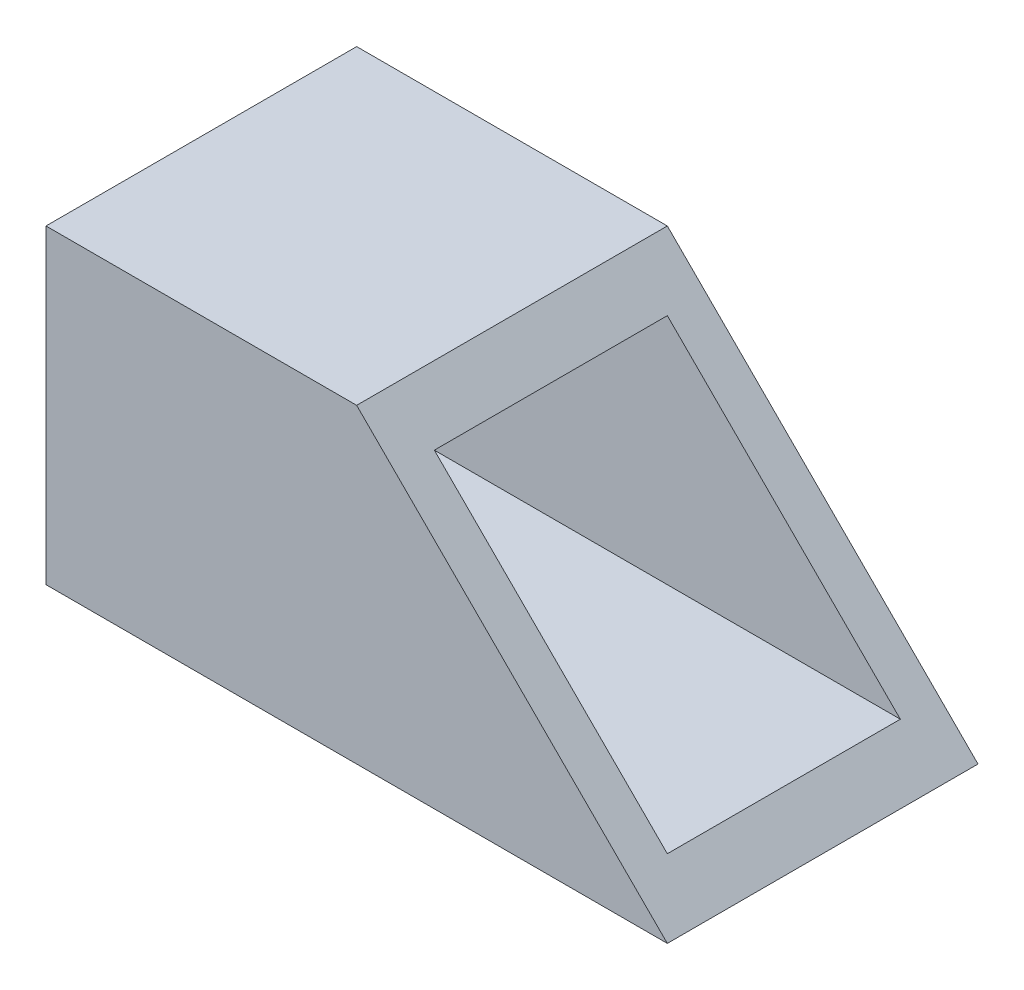
ISO-10303-21;
HEADER;
FILE_DESCRIPTION(('STEP AP214'),'2;1');
FILE_NAME('part.step','',(''),(''),'','','');
FILE_SCHEMA(('AUTOMOTIVE_DESIGN { 1 0 10303 214 1 1 1 1 }'));
ENDSEC;
DATA;
#1=APPLICATION_CONTEXT('core data for automotive mechanical design processes');
#2=APPLICATION_PROTOCOL_DEFINITION('international standard','automotive_design',2000,#1);
#3=PRODUCT_CONTEXT('',#1,'mechanical');
#4=PRODUCT('Part','Part','',(#3));
#5=PRODUCT_RELATED_PRODUCT_CATEGORY('part','',(#4));
#6=PRODUCT_DEFINITION_FORMATION('','',#4);
#7=PRODUCT_DEFINITION_CONTEXT('part definition',#1,'design');
#8=PRODUCT_DEFINITION('design','',#6,#7);
#9=PRODUCT_DEFINITION_SHAPE('','',#8);
#10=(LENGTH_UNIT() NAMED_UNIT(*) SI_UNIT(.MILLI.,.METRE.));
#11=(NAMED_UNIT(*) PLANE_ANGLE_UNIT() SI_UNIT($,.RADIAN.));
#12=(NAMED_UNIT(*) SI_UNIT($,.STERADIAN.) SOLID_ANGLE_UNIT());
#13=UNCERTAINTY_MEASURE_WITH_UNIT(LENGTH_MEASURE(1.E-05),#10,'distance_accuracy_value','');
#14=(GEOMETRIC_REPRESENTATION_CONTEXT(3) GLOBAL_UNCERTAINTY_ASSIGNED_CONTEXT((#13)) GLOBAL_UNIT_ASSIGNED_CONTEXT((#10,
#11,#12)) REPRESENTATION_CONTEXT('',''));
#15=CARTESIAN_POINT('',(0.,0.,0.));
#16=DIRECTION('',(0.,0.,1.));
#17=DIRECTION('',(1.,0.,0.));
#18=AXIS2_PLACEMENT_3D('',#15,#16,#17);
#19=CARTESIAN_POINT('',(0.,0.,0.));
#20=DIRECTION('',(1.,0.,0.));
#21=DIRECTION('',(0.,0.,-1.));
#22=AXIS2_PLACEMENT_3D('',#19,#20,#21);
#23=PLANE('',#22);
#24=DIRECTION('',(0.,-1.,0.));
#25=VECTOR('',#24,1.);
#26=CARTESIAN_POINT('',(0.,-12.7,12.7));
#27=LINE('',#26,#25);
#28=CARTESIAN_POINT('',(0.,12.7,12.7));
#29=VERTEX_POINT('',#28);
#30=CARTESIAN_POINT('',(0.,-12.7,12.7));
#31=VERTEX_POINT('',#30);
#32=EDGE_CURVE('E130',#29,#31,#27,.T.);
#33=ORIENTED_EDGE('',*,*,#32,.F.);
#34=DIRECTION('',(0.,0.,1.));
#35=VECTOR('',#34,1.);
#36=CARTESIAN_POINT('',(0.,12.7,-12.7));
#37=LINE('',#36,#35);
#38=CARTESIAN_POINT('',(0.,12.7,-12.7));
#39=VERTEX_POINT('',#38);
#40=EDGE_CURVE('E127',#39,#29,#37,.T.);
#41=ORIENTED_EDGE('',*,*,#40,.F.);
#42=DIRECTION('',(0.,1.,0.));
#43=VECTOR('',#42,1.);
#44=CARTESIAN_POINT('',(0.,-12.7,-12.7));
#45=LINE('',#44,#43);
#46=CARTESIAN_POINT('',(0.,-12.7,-12.7));
#47=VERTEX_POINT('',#46);
#48=EDGE_CURVE('E143',#47,#39,#45,.T.);
#49=ORIENTED_EDGE('',*,*,#48,.F.);
#50=DIRECTION('',(0.,0.,-1.));
#51=VECTOR('',#50,1.);
#52=CARTESIAN_POINT('',(0.,-12.7,-12.7));
#53=LINE('',#52,#51);
#54=EDGE_CURVE('E147',#31,#47,#53,.T.);
#55=ORIENTED_EDGE('',*,*,#54,.F.);
#56=EDGE_LOOP('',(#33,#41,#49,#55));
#57=FACE_BOUND('',#56,.T.);
#58=DIRECTION('',(0.,-1.,0.));
#59=VECTOR('',#58,1.);
#60=CARTESIAN_POINT('',(0.,-9.525,9.525));
#61=LINE('',#60,#59);
#62=CARTESIAN_POINT('',(0.,9.525,9.525));
#63=VERTEX_POINT('',#62);
#64=CARTESIAN_POINT('',(0.,-9.525,9.525));
#65=VERTEX_POINT('',#64);
#66=EDGE_CURVE('E176',#63,#65,#61,.T.);
#67=ORIENTED_EDGE('',*,*,#66,.T.);
#68=DIRECTION('',(0.,0.,-1.));
#69=VECTOR('',#68,1.);
#70=CARTESIAN_POINT('',(0.,-9.525,-9.525));
#71=LINE('',#70,#69);
#72=CARTESIAN_POINT('',(0.,-9.525,-9.525));
#73=VERTEX_POINT('',#72);
#74=EDGE_CURVE('E172',#65,#73,#71,.T.);
#75=ORIENTED_EDGE('',*,*,#74,.T.);
#76=DIRECTION('',(0.,1.,0.));
#77=VECTOR('',#76,1.);
#78=CARTESIAN_POINT('',(0.,-9.525,-9.525));
#79=LINE('',#78,#77);
#80=CARTESIAN_POINT('',(0.,9.525,-9.525));
#81=VERTEX_POINT('',#80);
#82=EDGE_CURVE('E168',#73,#81,#79,.T.);
#83=ORIENTED_EDGE('',*,*,#82,.T.);
#84=DIRECTION('',(0.,0.,1.));
#85=VECTOR('',#84,1.);
#86=CARTESIAN_POINT('',(0.,9.525,-9.525));
#87=LINE('',#86,#85);
#88=EDGE_CURVE('E164',#81,#63,#87,.T.);
#89=ORIENTED_EDGE('',*,*,#88,.T.);
#90=EDGE_LOOP('',(#67,#75,#83,#89));
#91=FACE_BOUND('',#90,.T.);
#92=ADVANCED_FACE('F45',(#57,#91),#23,.F.);
#93=CARTESIAN_POINT('',(50.8,-12.7,12.7));
#94=DIRECTION('',(0.,0.,-1.));
#95=DIRECTION('',(-1.,0.,0.));
#96=AXIS2_PLACEMENT_3D('',#93,#94,#95);
#97=PLANE('',#96);
#98=DIRECTION('',(-1.,0.,0.));
#99=VECTOR('',#98,1.);
#100=CARTESIAN_POINT('',(50.8,-12.7,12.7));
#101=LINE('',#100,#99);
#102=CARTESIAN_POINT('',(50.8,-12.7,12.7));
#103=VERTEX_POINT('',#102);
#104=EDGE_CURVE('E54',#103,#31,#101,.T.);
#105=ORIENTED_EDGE('',*,*,#104,.F.);
#106=DIRECTION('',(-0.707106781186546,0.707106781186549,0.));
#107=VECTOR('',#106,1.);
#108=CARTESIAN_POINT('',(50.8,-12.7,12.7));
#109=LINE('',#108,#107);
#110=CARTESIAN_POINT('',(25.4000000000001,12.7,12.7));
#111=VERTEX_POINT('',#110);
#112=EDGE_CURVE('E108',#103,#111,#109,.T.);
#113=ORIENTED_EDGE('',*,*,#112,.T.);
#114=DIRECTION('',(-1.,0.,0.));
#115=VECTOR('',#114,1.);
#116=CARTESIAN_POINT('',(50.8,12.7,12.7));
#117=LINE('',#116,#115);
#118=EDGE_CURVE('E126',#111,#29,#117,.T.);
#119=ORIENTED_EDGE('',*,*,#118,.T.);
#120=ORIENTED_EDGE('',*,*,#32,.T.);
#121=EDGE_LOOP('',(#105,#113,#119,#120));
#122=FACE_BOUND('',#121,.T.);
#123=ADVANCED_FACE('F47',(#122),#97,.F.);
#124=CARTESIAN_POINT('',(50.8,-12.7,-12.7));
#125=DIRECTION('',(0.,1.,0.));
#126=DIRECTION('',(0.,0.,1.));
#127=AXIS2_PLACEMENT_3D('',#124,#125,#126);
#128=PLANE('',#127);
#129=ORIENTED_EDGE('',*,*,#54,.T.);
#130=DIRECTION('',(-1.,0.,0.));
#131=VECTOR('',#130,1.);
#132=CARTESIAN_POINT('',(50.8,-12.7,-12.7));
#133=LINE('',#132,#131);
#134=CARTESIAN_POINT('',(50.8,-12.7,-12.7));
#135=VERTEX_POINT('',#134);
#136=EDGE_CURVE('E124',#135,#47,#133,.T.);
#137=ORIENTED_EDGE('',*,*,#136,.F.);
#138=DIRECTION('',(0.,0.,-1.));
#139=VECTOR('',#138,1.);
#140=CARTESIAN_POINT('',(50.8,-12.7,-12.7));
#141=LINE('',#140,#139);
#142=EDGE_CURVE('E111',#103,#135,#141,.T.);
#143=ORIENTED_EDGE('',*,*,#142,.F.);
#144=ORIENTED_EDGE('',*,*,#104,.T.);
#145=EDGE_LOOP('',(#129,#137,#143,#144));
#146=FACE_BOUND('',#145,.T.);
#147=ADVANCED_FACE('F121',(#146),#128,.F.);
#148=CARTESIAN_POINT('',(50.8,-12.7,-12.7));
#149=DIRECTION('',(0.,0.,1.));
#150=DIRECTION('',(1.,0.,0.));
#151=AXIS2_PLACEMENT_3D('',#148,#149,#150);
#152=PLANE('',#151);
#153=DIRECTION('',(-1.,0.,0.));
#154=VECTOR('',#153,1.);
#155=CARTESIAN_POINT('',(50.8,12.7,-12.7));
#156=LINE('',#155,#154);
#157=CARTESIAN_POINT('',(25.4000000000001,12.7,-12.7));
#158=VERTEX_POINT('',#157);
#159=EDGE_CURVE('E133',#158,#39,#156,.T.);
#160=ORIENTED_EDGE('',*,*,#159,.F.);
#161=DIRECTION('',(-0.707106781186546,0.707106781186549,0.));
#162=VECTOR('',#161,1.);
#163=CARTESIAN_POINT('',(50.8,-12.7,-12.7));
#164=LINE('',#163,#162);
#165=EDGE_CURVE('E61',#135,#158,#164,.T.);
#166=ORIENTED_EDGE('',*,*,#165,.F.);
#167=ORIENTED_EDGE('',*,*,#136,.T.);
#168=ORIENTED_EDGE('',*,*,#48,.T.);
#169=EDGE_LOOP('',(#160,#166,#167,#168));
#170=FACE_BOUND('',#169,.T.);
#171=ADVANCED_FACE('F195',(#170),#152,.F.);
#172=CARTESIAN_POINT('',(50.8,12.7,-12.7));
#173=DIRECTION('',(0.,-1.,0.));
#174=DIRECTION('',(0.,0.,-1.));
#175=AXIS2_PLACEMENT_3D('',#172,#173,#174);
#176=PLANE('',#175);
#177=ORIENTED_EDGE('',*,*,#118,.F.);
#178=DIRECTION('',(0.,0.,-1.));
#179=VECTOR('',#178,1.);
#180=CARTESIAN_POINT('',(25.4000000000001,12.7,12.7));
#181=LINE('',#180,#179);
#182=EDGE_CURVE('E112',#111,#158,#181,.T.);
#183=ORIENTED_EDGE('',*,*,#182,.T.);
#184=ORIENTED_EDGE('',*,*,#159,.T.);
#185=ORIENTED_EDGE('',*,*,#40,.T.);
#186=EDGE_LOOP('',(#177,#183,#184,#185));
#187=FACE_BOUND('',#186,.T.);
#188=ADVANCED_FACE('F193',(#187),#176,.F.);
#189=CARTESIAN_POINT('',(50.8,-9.525,9.525));
#190=DIRECTION('',(0.,0.,-1.));
#191=DIRECTION('',(-1.,0.,0.));
#192=AXIS2_PLACEMENT_3D('',#189,#190,#191);
#193=PLANE('',#192);
#194=DIRECTION('',(-0.707106781186546,0.707106781186549,0.));
#195=VECTOR('',#194,1.);
#196=CARTESIAN_POINT('',(49.2125,-11.1125,9.525));
#197=LINE('',#196,#195);
#198=CARTESIAN_POINT('',(47.625,-9.525,9.525));
#199=VERTEX_POINT('',#198);
#200=CARTESIAN_POINT('',(28.5750000000001,9.525,9.525));
#201=VERTEX_POINT('',#200);
#202=EDGE_CURVE('E68',#199,#201,#197,.T.);
#203=ORIENTED_EDGE('',*,*,#202,.F.);
#204=DIRECTION('',(-1.,0.,0.));
#205=VECTOR('',#204,1.);
#206=CARTESIAN_POINT('',(50.8,-9.525,9.525));
#207=LINE('',#206,#205);
#208=EDGE_CURVE('E151',#199,#65,#207,.T.);
#209=ORIENTED_EDGE('',*,*,#208,.T.);
#210=ORIENTED_EDGE('',*,*,#66,.F.);
#211=DIRECTION('',(-1.,0.,0.));
#212=VECTOR('',#211,1.);
#213=CARTESIAN_POINT('',(50.8,9.525,9.525));
#214=LINE('',#213,#212);
#215=EDGE_CURVE('E161',#201,#63,#214,.T.);
#216=ORIENTED_EDGE('',*,*,#215,.F.);
#217=EDGE_LOOP('',(#203,#209,#210,#216));
#218=FACE_BOUND('',#217,.T.);
#219=ADVANCED_FACE('F207',(#218),#193,.T.);
#220=CARTESIAN_POINT('',(50.8,-9.525,-9.525));
#221=DIRECTION('',(0.,1.,0.));
#222=DIRECTION('',(0.,0.,1.));
#223=AXIS2_PLACEMENT_3D('',#220,#221,#222);
#224=PLANE('',#223);
#225=DIRECTION('',(0.,0.,1.));
#226=VECTOR('',#225,1.);
#227=CARTESIAN_POINT('',(47.625,-9.525,-9.525));
#228=LINE('',#227,#226);
#229=CARTESIAN_POINT('',(47.625,-9.525,-9.525));
#230=VERTEX_POINT('',#229);
#231=EDGE_CURVE('E182',#230,#199,#228,.T.);
#232=ORIENTED_EDGE('',*,*,#231,.F.);
#233=DIRECTION('',(-1.,0.,0.));
#234=VECTOR('',#233,1.);
#235=CARTESIAN_POINT('',(50.8,-9.525,-9.525));
#236=LINE('',#235,#234);
#237=EDGE_CURVE('E155',#230,#73,#236,.T.);
#238=ORIENTED_EDGE('',*,*,#237,.T.);
#239=ORIENTED_EDGE('',*,*,#74,.F.);
#240=ORIENTED_EDGE('',*,*,#208,.F.);
#241=EDGE_LOOP('',(#232,#238,#239,#240));
#242=FACE_BOUND('',#241,.T.);
#243=ADVANCED_FACE('F211',(#242),#224,.T.);
#244=CARTESIAN_POINT('',(50.8,-9.525,-9.525));
#245=DIRECTION('',(0.,0.,1.));
#246=DIRECTION('',(1.,0.,0.));
#247=AXIS2_PLACEMENT_3D('',#244,#245,#246);
#248=PLANE('',#247);
#249=DIRECTION('',(0.707106781186546,-0.707106781186549,0.));
#250=VECTOR('',#249,1.);
#251=CARTESIAN_POINT('',(49.2125,-11.1125,-9.525));
#252=LINE('',#251,#250);
#253=CARTESIAN_POINT('',(28.5750000000001,9.525,-9.525));
#254=VERTEX_POINT('',#253);
#255=EDGE_CURVE('E185',#254,#230,#252,.T.);
#256=ORIENTED_EDGE('',*,*,#255,.F.);
#257=DIRECTION('',(-1.,0.,0.));
#258=VECTOR('',#257,1.);
#259=CARTESIAN_POINT('',(50.8,9.525,-9.525));
#260=LINE('',#259,#258);
#261=EDGE_CURVE('E158',#254,#81,#260,.T.);
#262=ORIENTED_EDGE('',*,*,#261,.T.);
#263=ORIENTED_EDGE('',*,*,#82,.F.);
#264=ORIENTED_EDGE('',*,*,#237,.F.);
#265=EDGE_LOOP('',(#256,#262,#263,#264));
#266=FACE_BOUND('',#265,.T.);
#267=ADVANCED_FACE('F216',(#266),#248,.T.);
#268=CARTESIAN_POINT('',(50.8,9.525,-9.525));
#269=DIRECTION('',(0.,-1.,0.));
#270=DIRECTION('',(0.,0.,-1.));
#271=AXIS2_PLACEMENT_3D('',#268,#269,#270);
#272=PLANE('',#271);
#273=DIRECTION('',(0.,0.,-1.));
#274=VECTOR('',#273,1.);
#275=CARTESIAN_POINT('',(28.5750000000001,9.525,-9.525));
#276=LINE('',#275,#274);
#277=EDGE_CURVE('E11',#201,#254,#276,.T.);
#278=ORIENTED_EDGE('',*,*,#277,.F.);
#279=ORIENTED_EDGE('',*,*,#215,.T.);
#280=ORIENTED_EDGE('',*,*,#88,.F.);
#281=ORIENTED_EDGE('',*,*,#261,.F.);
#282=EDGE_LOOP('',(#278,#279,#280,#281));
#283=FACE_BOUND('',#282,.T.);
#284=ADVANCED_FACE('F219',(#283),#272,.T.);
#285=CARTESIAN_POINT('',(50.8,-12.7,12.7));
#286=DIRECTION('',(-0.707106781186549,-0.707106781186546,0.));
#287=DIRECTION('',(0.707106781186546,-0.707106781186549,0.));
#288=AXIS2_PLACEMENT_3D('',#285,#286,#287);
#289=PLANE('',#288);
#290=ORIENTED_EDGE('',*,*,#202,.T.);
#291=ORIENTED_EDGE('',*,*,#277,.T.);
#292=ORIENTED_EDGE('',*,*,#255,.T.);
#293=ORIENTED_EDGE('',*,*,#231,.T.);
#294=EDGE_LOOP('',(#290,#291,#292,#293));
#295=FACE_BOUND('',#294,.T.);
#296=ORIENTED_EDGE('',*,*,#165,.T.);
#297=ORIENTED_EDGE('',*,*,#182,.F.);
#298=ORIENTED_EDGE('',*,*,#112,.F.);
#299=ORIENTED_EDGE('',*,*,#142,.T.);
#300=EDGE_LOOP('',(#296,#297,#298,#299));
#301=FACE_BOUND('',#300,.T.);
#302=ADVANCED_FACE('F110',(#295,#301),#289,.F.);
#303=CLOSED_SHELL('',(#92,#123,#147,#171,#188,#219,#243,#267,#284,#302));
#304=MANIFOLD_SOLID_BREP('B2',#303);
#305=ADVANCED_BREP_SHAPE_REPRESENTATION('',(#18,#304),#14);
#306=SHAPE_DEFINITION_REPRESENTATION(#9,#305);
ENDSEC;
END-ISO-10303-21;
